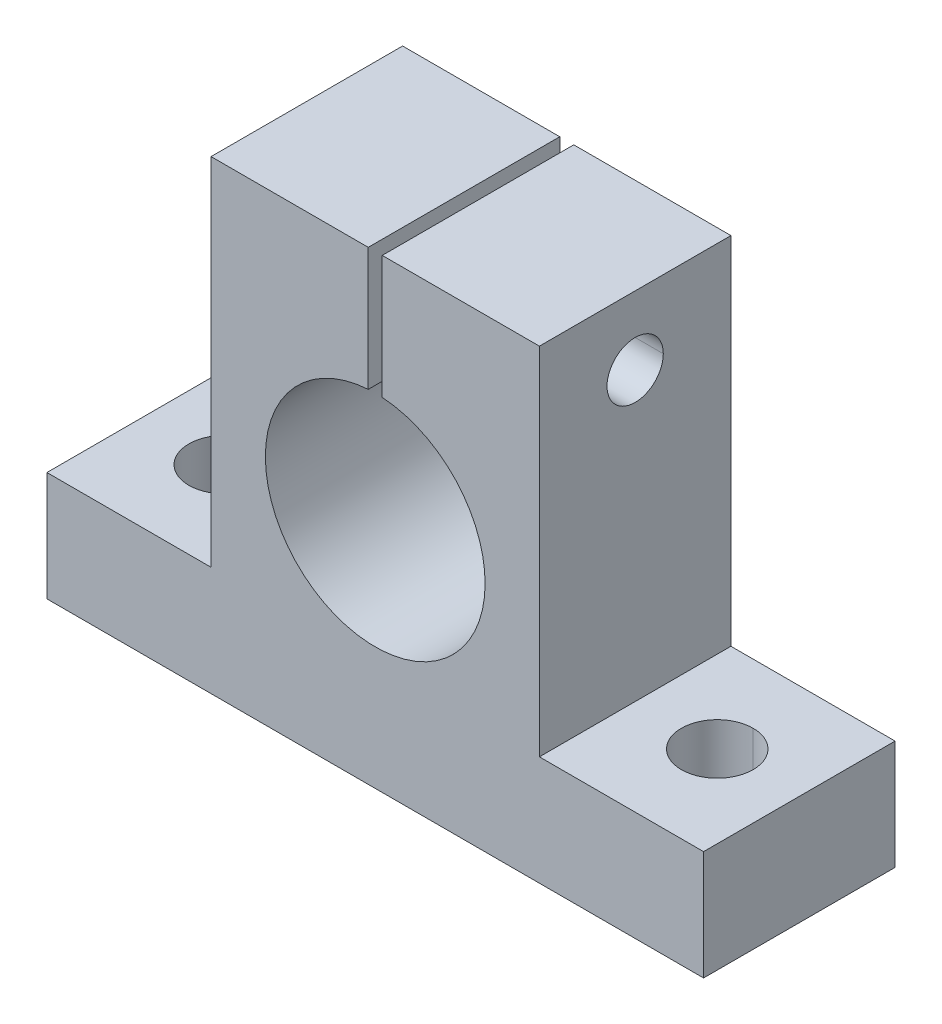
ISO-10303-21;
HEADER;
FILE_DESCRIPTION(('STEP AP214'),'2;1');
FILE_NAME('part.step','',(''),(''),'','','');
FILE_SCHEMA(('AUTOMOTIVE_DESIGN { 1 0 10303 214 1 1 1 1 }'));
ENDSEC;
DATA;
#1=APPLICATION_CONTEXT('core data for automotive mechanical design processes');
#2=APPLICATION_PROTOCOL_DEFINITION('international standard','automotive_design',2000,#1);
#3=PRODUCT_CONTEXT('',#1,'mechanical');
#4=PRODUCT('Part','Part','',(#3));
#5=PRODUCT_RELATED_PRODUCT_CATEGORY('part','',(#4));
#6=PRODUCT_DEFINITION_FORMATION('','',#4);
#7=PRODUCT_DEFINITION_CONTEXT('part definition',#1,'design');
#8=PRODUCT_DEFINITION('design','',#6,#7);
#9=PRODUCT_DEFINITION_SHAPE('','',#8);
#10=(LENGTH_UNIT() NAMED_UNIT(*) SI_UNIT(.MILLI.,.METRE.));
#11=(NAMED_UNIT(*) PLANE_ANGLE_UNIT() SI_UNIT($,.RADIAN.));
#12=(NAMED_UNIT(*) SI_UNIT($,.STERADIAN.) SOLID_ANGLE_UNIT());
#13=UNCERTAINTY_MEASURE_WITH_UNIT(LENGTH_MEASURE(1.E-05),#10,'distance_accuracy_value','');
#14=(GEOMETRIC_REPRESENTATION_CONTEXT(3) GLOBAL_UNCERTAINTY_ASSIGNED_CONTEXT((#13)) GLOBAL_UNIT_ASSIGNED_CONTEXT((#10,
#11,#12)) REPRESENTATION_CONTEXT('',''));
#15=CARTESIAN_POINT('',(0.,0.,0.));
#16=DIRECTION('',(0.,0.,1.));
#17=DIRECTION('',(1.,0.,0.));
#18=AXIS2_PLACEMENT_3D('',#15,#16,#17);
#19=CARTESIAN_POINT('',(-19.05,12.7,11.1125));
#20=DIRECTION('',(0.,-1.,0.));
#21=DIRECTION('',(0.,0.,-1.));
#22=AXIS2_PLACEMENT_3D('',#19,#20,#21);
#23=PLANE('',#22);
#24=CARTESIAN_POINT('',(-28.575,12.7,0.));
#25=DIRECTION('',(0.,1.,0.));
#26=DIRECTION('',(1.,0.,0.));
#27=AXIS2_PLACEMENT_3D('',#24,#25,#26);
#28=CIRCLE('',#27,4.1656);
#29=CARTESIAN_POINT('',(-28.575,12.7,-4.1656));
#30=VERTEX_POINT('',#29);
#31=CARTESIAN_POINT('',(-28.575,12.7,4.1656));
#32=VERTEX_POINT('',#31);
#33=EDGE_CURVE('E11',#30,#32,#28,.T.);
#34=ORIENTED_EDGE('',*,*,#33,.F.);
#35=CARTESIAN_POINT('',(-28.575,12.7,0.));
#36=DIRECTION('',(0.,1.,0.));
#37=DIRECTION('',(0.,0.,1.));
#38=AXIS2_PLACEMENT_3D('',#35,#36,#37);
#39=CIRCLE('',#38,4.1656);
#40=EDGE_CURVE('E24',#32,#30,#39,.T.);
#41=ORIENTED_EDGE('',*,*,#40,.F.);
#42=EDGE_LOOP('',(#34,#41));
#43=FACE_BOUND('',#42,.T.);
#44=DIRECTION('',(-1.,0.,0.));
#45=VECTOR('',#44,1.);
#46=CARTESIAN_POINT('',(-19.05,12.7,-11.1125));
#47=LINE('',#46,#45);
#48=CARTESIAN_POINT('',(-19.05,12.7,-11.1125));
#49=VERTEX_POINT('',#48);
#50=CARTESIAN_POINT('',(-38.1,12.7,-11.1125));
#51=VERTEX_POINT('',#50);
#52=EDGE_CURVE('E389',#49,#51,#47,.T.);
#53=ORIENTED_EDGE('',*,*,#52,.T.);
#54=DIRECTION('',(0.,0.,-1.));
#55=VECTOR('',#54,1.);
#56=CARTESIAN_POINT('',(-38.1,12.7,11.1125));
#57=LINE('',#56,#55);
#58=CARTESIAN_POINT('',(-38.1,12.7,11.1125));
#59=VERTEX_POINT('',#58);
#60=EDGE_CURVE('E166',#59,#51,#57,.T.);
#61=ORIENTED_EDGE('',*,*,#60,.F.);
#62=DIRECTION('',(-1.,0.,0.));
#63=VECTOR('',#62,1.);
#64=CARTESIAN_POINT('',(-19.05,12.7,11.1125));
#65=LINE('',#64,#63);
#66=CARTESIAN_POINT('',(-19.05,12.7,11.1125));
#67=VERTEX_POINT('',#66);
#68=EDGE_CURVE('E381',#67,#59,#65,.T.);
#69=ORIENTED_EDGE('',*,*,#68,.F.);
#70=DIRECTION('',(0.,0.,-1.));
#71=VECTOR('',#70,1.);
#72=CARTESIAN_POINT('',(-19.05,12.7,11.1125));
#73=LINE('',#72,#71);
#74=EDGE_CURVE('E377',#67,#49,#73,.T.);
#75=ORIENTED_EDGE('',*,*,#74,.T.);
#76=EDGE_LOOP('',(#53,#61,#69,#75));
#77=FACE_BOUND('',#76,.T.);
#78=ADVANCED_FACE('F16',(#43,#77),#23,.F.);
#79=CARTESIAN_POINT('',(-19.05,53.975,11.1125));
#80=DIRECTION('',(1.,0.,0.));
#81=DIRECTION('',(0.,0.,-1.));
#82=AXIS2_PLACEMENT_3D('',#79,#80,#81);
#83=PLANE('',#82);
#84=CARTESIAN_POINT('',(-19.05,46.0248,0.));
#85=DIRECTION('',(1.,0.,0.));
#86=DIRECTION('',(0.,0.,-1.));
#87=AXIS2_PLACEMENT_3D('',#84,#85,#86);
#88=CIRCLE('',#87,2.48793);
#89=CARTESIAN_POINT('',(-19.05,46.0248,-2.48793));
#90=VERTEX_POINT('',#89);
#91=CARTESIAN_POINT('',(-19.05,46.0248,2.48793));
#92=VERTEX_POINT('',#91);
#93=EDGE_CURVE('E373',#90,#92,#88,.T.);
#94=ORIENTED_EDGE('',*,*,#93,.T.);
#95=CARTESIAN_POINT('',(-19.05,46.0248,0.));
#96=DIRECTION('',(1.,0.,0.));
#97=DIRECTION('',(0.,0.,-1.));
#98=AXIS2_PLACEMENT_3D('',#95,#96,#97);
#99=CIRCLE('',#98,2.48793);
#100=EDGE_CURVE('E369',#92,#90,#99,.T.);
#101=ORIENTED_EDGE('',*,*,#100,.T.);
#102=EDGE_LOOP('',(#94,#101));
#103=FACE_BOUND('',#102,.T.);
#104=DIRECTION('',(0.,-1.,0.));
#105=VECTOR('',#104,1.);
#106=CARTESIAN_POINT('',(-19.05,53.975,-11.1125));
#107=LINE('',#106,#105);
#108=CARTESIAN_POINT('',(-19.05,53.975,-11.1125));
#109=VERTEX_POINT('',#108);
#110=EDGE_CURVE('E364',#109,#49,#107,.T.);
#111=ORIENTED_EDGE('',*,*,#110,.T.);
#112=ORIENTED_EDGE('',*,*,#74,.F.);
#113=DIRECTION('',(0.,-1.,0.));
#114=VECTOR('',#113,1.);
#115=CARTESIAN_POINT('',(-19.05,53.975,11.1125));
#116=LINE('',#115,#114);
#117=CARTESIAN_POINT('',(-19.05,53.975,11.1125));
#118=VERTEX_POINT('',#117);
#119=EDGE_CURVE('E359',#118,#67,#116,.T.);
#120=ORIENTED_EDGE('',*,*,#119,.F.);
#121=DIRECTION('',(0.,0.,-1.));
#122=VECTOR('',#121,1.);
#123=CARTESIAN_POINT('',(-19.05,53.975,11.1125));
#124=LINE('',#123,#122);
#125=EDGE_CURVE('E355',#118,#109,#124,.T.);
#126=ORIENTED_EDGE('',*,*,#125,.T.);
#127=EDGE_LOOP('',(#111,#112,#120,#126));
#128=FACE_BOUND('',#127,.T.);
#129=ADVANCED_FACE('F441',(#103,#128),#83,.F.);
#130=CARTESIAN_POINT('',(-0.8128,53.975,11.1125));
#131=DIRECTION('',(0.,-1.,0.));
#132=DIRECTION('',(0.,0.,-1.));
#133=AXIS2_PLACEMENT_3D('',#130,#131,#132);
#134=PLANE('',#133);
#135=DIRECTION('',(-1.,0.,0.));
#136=VECTOR('',#135,1.);
#137=CARTESIAN_POINT('',(-0.8128,53.975,-11.1125));
#138=LINE('',#137,#136);
#139=CARTESIAN_POINT('',(-0.8128,53.975,-11.1125));
#140=VERTEX_POINT('',#139);
#141=EDGE_CURVE('E350',#140,#109,#138,.T.);
#142=ORIENTED_EDGE('',*,*,#141,.T.);
#143=ORIENTED_EDGE('',*,*,#125,.F.);
#144=DIRECTION('',(-1.,0.,0.));
#145=VECTOR('',#144,1.);
#146=CARTESIAN_POINT('',(-0.8128,53.975,11.1125));
#147=LINE('',#146,#145);
#148=CARTESIAN_POINT('',(-0.8128,53.975,11.1125));
#149=VERTEX_POINT('',#148);
#150=EDGE_CURVE('E345',#149,#118,#147,.T.);
#151=ORIENTED_EDGE('',*,*,#150,.F.);
#152=DIRECTION('',(0.,0.,-1.));
#153=VECTOR('',#152,1.);
#154=CARTESIAN_POINT('',(-0.8128,53.975,11.1125));
#155=LINE('',#154,#153);
#156=EDGE_CURVE('E341',#149,#140,#155,.T.);
#157=ORIENTED_EDGE('',*,*,#156,.T.);
#158=EDGE_LOOP('',(#142,#143,#151,#157));
#159=FACE_BOUND('',#158,.T.);
#160=ADVANCED_FACE('F447',(#159),#134,.F.);
#161=CARTESIAN_POINT('',(-0.8128,39.6996676535361,11.1125));
#162=DIRECTION('',(-1.,0.,0.));
#163=DIRECTION('',(0.,0.,1.));
#164=AXIS2_PLACEMENT_3D('',#161,#162,#163);
#165=PLANE('',#164);
#166=DIRECTION('',(0.,1.,0.));
#167=VECTOR('',#166,1.);
#168=CARTESIAN_POINT('',(-0.8128,39.6996676535361,-11.1125));
#169=LINE('',#168,#167);
#170=CARTESIAN_POINT('',(-0.8128,39.6996676535361,-11.1125));
#171=VERTEX_POINT('',#170);
#172=EDGE_CURVE('E336',#171,#140,#169,.T.);
#173=ORIENTED_EDGE('',*,*,#172,.T.);
#174=ORIENTED_EDGE('',*,*,#156,.F.);
#175=DIRECTION('',(0.,1.,0.));
#176=VECTOR('',#175,1.);
#177=CARTESIAN_POINT('',(-0.8128,39.6996676535361,11.1125));
#178=LINE('',#177,#176);
#179=CARTESIAN_POINT('',(-0.8128,39.6996676535361,11.1125));
#180=VERTEX_POINT('',#179);
#181=EDGE_CURVE('E331',#180,#149,#178,.T.);
#182=ORIENTED_EDGE('',*,*,#181,.F.);
#183=DIRECTION('',(0.,0.,-1.));
#184=VECTOR('',#183,1.);
#185=CARTESIAN_POINT('',(-0.8128,39.6996676535361,11.1125));
#186=LINE('',#185,#184);
#187=EDGE_CURVE('E327',#180,#171,#186,.T.);
#188=ORIENTED_EDGE('',*,*,#187,.T.);
#189=EDGE_LOOP('',(#173,#174,#182,#188));
#190=FACE_BOUND('',#189,.T.);
#191=CARTESIAN_POINT('',(-0.8128,46.0248,0.));
#192=DIRECTION('',(1.,0.,0.));
#193=DIRECTION('',(0.,0.,-1.));
#194=AXIS2_PLACEMENT_3D('',#191,#192,#193);
#195=CIRCLE('',#194,2.48793);
#196=CARTESIAN_POINT('',(-0.812799999999999,46.0248,2.48793));
#197=VERTEX_POINT('',#196);
#198=CARTESIAN_POINT('',(-0.8128,46.0248,-2.48793));
#199=VERTEX_POINT('',#198);
#200=EDGE_CURVE('E322',#197,#199,#195,.T.);
#201=ORIENTED_EDGE('',*,*,#200,.F.);
#202=CARTESIAN_POINT('',(-0.8128,46.0248,0.));
#203=DIRECTION('',(1.,0.,0.));
#204=DIRECTION('',(0.,0.,-1.));
#205=AXIS2_PLACEMENT_3D('',#202,#203,#204);
#206=CIRCLE('',#205,2.48793);
#207=EDGE_CURVE('E317',#199,#197,#206,.T.);
#208=ORIENTED_EDGE('',*,*,#207,.F.);
#209=EDGE_LOOP('',(#201,#208));
#210=FACE_BOUND('',#209,.T.);
#211=ADVANCED_FACE('F450',(#190,#210),#165,.F.);
#212=CARTESIAN_POINT('',(19.05,46.0248,0.));
#213=DIRECTION('',(1.,0.,0.));
#214=DIRECTION('',(0.,-1.,0.));
#215=AXIS2_PLACEMENT_3D('',#212,#213,#214);
#216=CYLINDRICAL_SURFACE('',#215,2.48793);
#217=DIRECTION('',(1.,0.,0.));
#218=VECTOR('',#217,1.);
#219=CARTESIAN_POINT('',(-19.05,46.0248,2.48793));
#220=LINE('',#219,#218);
#221=EDGE_CURVE('E312',#92,#197,#220,.T.);
#222=ORIENTED_EDGE('',*,*,#221,.F.);
#223=ORIENTED_EDGE('',*,*,#93,.F.);
#224=DIRECTION('',(1.,0.,0.));
#225=VECTOR('',#224,1.);
#226=CARTESIAN_POINT('',(-19.05,46.0248,-2.48793));
#227=LINE('',#226,#225);
#228=EDGE_CURVE('E307',#90,#199,#227,.T.);
#229=ORIENTED_EDGE('',*,*,#228,.T.);
#230=ORIENTED_EDGE('',*,*,#207,.T.);
#231=EDGE_LOOP('',(#222,#223,#229,#230));
#232=FACE_BOUND('',#231,.T.);
#233=ADVANCED_FACE('F498',(#232),#216,.F.);
#234=CARTESIAN_POINT('',(19.05,46.0248,0.));
#235=DIRECTION('',(1.,0.,0.));
#236=DIRECTION('',(0.,1.,0.));
#237=AXIS2_PLACEMENT_3D('',#234,#235,#236);
#238=CYLINDRICAL_SURFACE('',#237,2.48793);
#239=ORIENTED_EDGE('',*,*,#221,.T.);
#240=ORIENTED_EDGE('',*,*,#200,.T.);
#241=ORIENTED_EDGE('',*,*,#228,.F.);
#242=ORIENTED_EDGE('',*,*,#100,.F.);
#243=EDGE_LOOP('',(#239,#240,#241,#242));
#244=FACE_BOUND('',#243,.T.);
#245=ADVANCED_FACE('F501',(#244),#238,.F.);
#246=CARTESIAN_POINT('',(0.,26.9748,11.1125));
#247=DIRECTION('',(0.,0.,-1.));
#248=DIRECTION('',(0.,1.,0.));
#249=AXIS2_PLACEMENT_3D('',#246,#247,#248);
#250=CYLINDRICAL_SURFACE('',#249,12.7508000000002);
#251=CARTESIAN_POINT('',(0.,26.9748,-11.1125));
#252=DIRECTION('',(0.,0.,1.));
#253=DIRECTION('',(1.,0.,0.));
#254=AXIS2_PLACEMENT_3D('',#251,#252,#253);
#255=CIRCLE('',#254,12.7508000000002);
#256=CARTESIAN_POINT('',(0.8128,39.6996676535361,-11.1125));
#257=VERTEX_POINT('',#256);
#258=EDGE_CURVE('E302',#171,#257,#255,.T.);
#259=ORIENTED_EDGE('',*,*,#258,.F.);
#260=ORIENTED_EDGE('',*,*,#187,.F.);
#261=CARTESIAN_POINT('',(0.,26.9748,11.1125));
#262=DIRECTION('',(0.,0.,1.));
#263=DIRECTION('',(1.,0.,0.));
#264=AXIS2_PLACEMENT_3D('',#261,#262,#263);
#265=CIRCLE('',#264,12.7508000000002);
#266=CARTESIAN_POINT('',(0.8128,39.6996676535361,11.1125));
#267=VERTEX_POINT('',#266);
#268=EDGE_CURVE('E298',#180,#267,#265,.T.);
#269=ORIENTED_EDGE('',*,*,#268,.T.);
#270=DIRECTION('',(0.,0.,-1.));
#271=VECTOR('',#270,1.);
#272=CARTESIAN_POINT('',(0.8128,39.6996676535361,11.1125));
#273=LINE('',#272,#271);
#274=EDGE_CURVE('E294',#267,#257,#273,.T.);
#275=ORIENTED_EDGE('',*,*,#274,.T.);
#276=EDGE_LOOP('',(#259,#260,#269,#275));
#277=FACE_BOUND('',#276,.T.);
#278=ADVANCED_FACE('F456',(#277),#250,.F.);
#279=CARTESIAN_POINT('',(0.8128,53.975,11.1125));
#280=DIRECTION('',(1.,0.,0.));
#281=DIRECTION('',(0.,0.,-1.));
#282=AXIS2_PLACEMENT_3D('',#279,#280,#281);
#283=PLANE('',#282);
#284=CARTESIAN_POINT('',(0.8128,46.0248,0.));
#285=DIRECTION('',(-1.,0.,0.));
#286=DIRECTION('',(0.,0.,-1.));
#287=AXIS2_PLACEMENT_3D('',#284,#285,#286);
#288=CIRCLE('',#287,3.2639);
#289=CARTESIAN_POINT('',(0.812799999999999,46.0248,3.2639));
#290=VERTEX_POINT('',#289);
#291=CARTESIAN_POINT('',(0.8128,46.0248,-3.2639));
#292=VERTEX_POINT('',#291);
#293=EDGE_CURVE('E289',#290,#292,#288,.T.);
#294=ORIENTED_EDGE('',*,*,#293,.F.);
#295=CARTESIAN_POINT('',(0.8128,46.0248,0.));
#296=DIRECTION('',(-1.,0.,0.));
#297=DIRECTION('',(0.,0.,-1.));
#298=AXIS2_PLACEMENT_3D('',#295,#296,#297);
#299=CIRCLE('',#298,3.2639);
#300=EDGE_CURVE('E284',#292,#290,#299,.T.);
#301=ORIENTED_EDGE('',*,*,#300,.F.);
#302=EDGE_LOOP('',(#294,#301));
#303=FACE_BOUND('',#302,.T.);
#304=DIRECTION('',(0.,-1.,0.));
#305=VECTOR('',#304,1.);
#306=CARTESIAN_POINT('',(0.8128,53.975,-11.1125));
#307=LINE('',#306,#305);
#308=CARTESIAN_POINT('',(0.8128,53.975,-11.1125));
#309=VERTEX_POINT('',#308);
#310=EDGE_CURVE('E279',#309,#257,#307,.T.);
#311=ORIENTED_EDGE('',*,*,#310,.T.);
#312=ORIENTED_EDGE('',*,*,#274,.F.);
#313=DIRECTION('',(0.,-1.,0.));
#314=VECTOR('',#313,1.);
#315=CARTESIAN_POINT('',(0.8128,53.975,11.1125));
#316=LINE('',#315,#314);
#317=CARTESIAN_POINT('',(0.8128,53.975,11.1125));
#318=VERTEX_POINT('',#317);
#319=EDGE_CURVE('E274',#318,#267,#316,.T.);
#320=ORIENTED_EDGE('',*,*,#319,.F.);
#321=DIRECTION('',(0.,0.,-1.));
#322=VECTOR('',#321,1.);
#323=CARTESIAN_POINT('',(0.8128,53.975,11.1125));
#324=LINE('',#323,#322);
#325=EDGE_CURVE('E270',#318,#309,#324,.T.);
#326=ORIENTED_EDGE('',*,*,#325,.T.);
#327=EDGE_LOOP('',(#311,#312,#320,#326));
#328=FACE_BOUND('',#327,.T.);
#329=ADVANCED_FACE('F462',(#303,#328),#283,.F.);
#330=CARTESIAN_POINT('',(19.05,53.975,11.1125));
#331=DIRECTION('',(0.,-1.,0.));
#332=DIRECTION('',(0.,0.,-1.));
#333=AXIS2_PLACEMENT_3D('',#330,#331,#332);
#334=PLANE('',#333);
#335=DIRECTION('',(-1.,0.,0.));
#336=VECTOR('',#335,1.);
#337=CARTESIAN_POINT('',(19.05,53.975,-11.1125));
#338=LINE('',#337,#336);
#339=CARTESIAN_POINT('',(19.05,53.975,-11.1125));
#340=VERTEX_POINT('',#339);
#341=EDGE_CURVE('E265',#340,#309,#338,.T.);
#342=ORIENTED_EDGE('',*,*,#341,.T.);
#343=ORIENTED_EDGE('',*,*,#325,.F.);
#344=DIRECTION('',(-1.,0.,0.));
#345=VECTOR('',#344,1.);
#346=CARTESIAN_POINT('',(19.05,53.975,11.1125));
#347=LINE('',#346,#345);
#348=CARTESIAN_POINT('',(19.05,53.975,11.1125));
#349=VERTEX_POINT('',#348);
#350=EDGE_CURVE('E260',#349,#318,#347,.T.);
#351=ORIENTED_EDGE('',*,*,#350,.F.);
#352=DIRECTION('',(0.,0.,-1.));
#353=VECTOR('',#352,1.);
#354=CARTESIAN_POINT('',(19.05,53.975,11.1125));
#355=LINE('',#354,#353);
#356=EDGE_CURVE('E256',#349,#340,#355,.T.);
#357=ORIENTED_EDGE('',*,*,#356,.T.);
#358=EDGE_LOOP('',(#342,#343,#351,#357));
#359=FACE_BOUND('',#358,.T.);
#360=ADVANCED_FACE('F465',(#359),#334,.F.);
#361=CARTESIAN_POINT('',(19.05,12.7,11.1125));
#362=DIRECTION('',(-1.,0.,0.));
#363=DIRECTION('',(0.,0.,1.));
#364=AXIS2_PLACEMENT_3D('',#361,#362,#363);
#365=PLANE('',#364);
#366=CARTESIAN_POINT('',(19.05,46.0248,0.));
#367=DIRECTION('',(1.,0.,0.));
#368=DIRECTION('',(0.,0.,-1.));
#369=AXIS2_PLACEMENT_3D('',#366,#367,#368);
#370=CIRCLE('',#369,3.2639);
#371=CARTESIAN_POINT('',(19.05,46.0248,3.2639));
#372=VERTEX_POINT('',#371);
#373=CARTESIAN_POINT('',(19.05,46.0248,-3.2639));
#374=VERTEX_POINT('',#373);
#375=EDGE_CURVE('E251',#372,#374,#370,.T.);
#376=ORIENTED_EDGE('',*,*,#375,.F.);
#377=CARTESIAN_POINT('',(19.05,46.0248,0.));
#378=DIRECTION('',(1.,0.,0.));
#379=DIRECTION('',(0.,0.,-1.));
#380=AXIS2_PLACEMENT_3D('',#377,#378,#379);
#381=CIRCLE('',#380,3.2639);
#382=EDGE_CURVE('E246',#374,#372,#381,.T.);
#383=ORIENTED_EDGE('',*,*,#382,.F.);
#384=EDGE_LOOP('',(#376,#383));
#385=FACE_BOUND('',#384,.T.);
#386=DIRECTION('',(0.,1.,0.));
#387=VECTOR('',#386,1.);
#388=CARTESIAN_POINT('',(19.05,12.7,-11.1125));
#389=LINE('',#388,#387);
#390=CARTESIAN_POINT('',(19.05,12.7,-11.1125));
#391=VERTEX_POINT('',#390);
#392=EDGE_CURVE('E241',#391,#340,#389,.T.);
#393=ORIENTED_EDGE('',*,*,#392,.T.);
#394=ORIENTED_EDGE('',*,*,#356,.F.);
#395=DIRECTION('',(0.,1.,0.));
#396=VECTOR('',#395,1.);
#397=CARTESIAN_POINT('',(19.05,12.7,11.1125));
#398=LINE('',#397,#396);
#399=CARTESIAN_POINT('',(19.05,12.7,11.1125));
#400=VERTEX_POINT('',#399);
#401=EDGE_CURVE('E236',#400,#349,#398,.T.);
#402=ORIENTED_EDGE('',*,*,#401,.F.);
#403=DIRECTION('',(0.,0.,-1.));
#404=VECTOR('',#403,1.);
#405=CARTESIAN_POINT('',(19.05,12.7,11.1125));
#406=LINE('',#405,#404);
#407=EDGE_CURVE('E232',#400,#391,#406,.T.);
#408=ORIENTED_EDGE('',*,*,#407,.T.);
#409=EDGE_LOOP('',(#393,#394,#402,#408));
#410=FACE_BOUND('',#409,.T.);
#411=ADVANCED_FACE('F468',(#385,#410),#365,.F.);
#412=CARTESIAN_POINT('',(38.1,12.7,11.1125));
#413=DIRECTION('',(0.,-1.,0.));
#414=DIRECTION('',(0.,0.,-1.));
#415=AXIS2_PLACEMENT_3D('',#412,#413,#414);
#416=PLANE('',#415);
#417=CARTESIAN_POINT('',(28.575,12.7,0.));
#418=DIRECTION('',(0.,1.,0.));
#419=DIRECTION('',(1.,0.,0.));
#420=AXIS2_PLACEMENT_3D('',#417,#418,#419);
#421=CIRCLE('',#420,4.1656);
#422=CARTESIAN_POINT('',(28.575,12.7,-4.1656));
#423=VERTEX_POINT('',#422);
#424=CARTESIAN_POINT('',(28.575,12.7,4.1656));
#425=VERTEX_POINT('',#424);
#426=EDGE_CURVE('E227',#423,#425,#421,.T.);
#427=ORIENTED_EDGE('',*,*,#426,.F.);
#428=CARTESIAN_POINT('',(28.575,12.7,0.));
#429=DIRECTION('',(0.,1.,0.));
#430=DIRECTION('',(0.,0.,1.));
#431=AXIS2_PLACEMENT_3D('',#428,#429,#430);
#432=CIRCLE('',#431,4.1656);
#433=EDGE_CURVE('E222',#425,#423,#432,.T.);
#434=ORIENTED_EDGE('',*,*,#433,.F.);
#435=EDGE_LOOP('',(#427,#434));
#436=FACE_BOUND('',#435,.T.);
#437=DIRECTION('',(-1.,0.,0.));
#438=VECTOR('',#437,1.);
#439=CARTESIAN_POINT('',(38.1,12.7,-11.1125));
#440=LINE('',#439,#438);
#441=CARTESIAN_POINT('',(38.1,12.7,-11.1125));
#442=VERTEX_POINT('',#441);
#443=EDGE_CURVE('E217',#442,#391,#440,.T.);
#444=ORIENTED_EDGE('',*,*,#443,.T.);
#445=ORIENTED_EDGE('',*,*,#407,.F.);
#446=DIRECTION('',(-1.,0.,0.));
#447=VECTOR('',#446,1.);
#448=CARTESIAN_POINT('',(38.1,12.7,11.1125));
#449=LINE('',#448,#447);
#450=CARTESIAN_POINT('',(38.1,12.7,11.1125));
#451=VERTEX_POINT('',#450);
#452=EDGE_CURVE('E212',#451,#400,#449,.T.);
#453=ORIENTED_EDGE('',*,*,#452,.F.);
#454=DIRECTION('',(0.,0.,-1.));
#455=VECTOR('',#454,1.);
#456=CARTESIAN_POINT('',(38.1,12.7,11.1125));
#457=LINE('',#456,#455);
#458=EDGE_CURVE('E208',#451,#442,#457,.T.);
#459=ORIENTED_EDGE('',*,*,#458,.T.);
#460=EDGE_LOOP('',(#444,#445,#453,#459));
#461=FACE_BOUND('',#460,.T.);
#462=ADVANCED_FACE('F471',(#436,#461),#416,.F.);
#463=CARTESIAN_POINT('',(38.1,0.,11.1125));
#464=DIRECTION('',(-1.,0.,0.));
#465=DIRECTION('',(0.,0.,1.));
#466=AXIS2_PLACEMENT_3D('',#463,#464,#465);
#467=PLANE('',#466);
#468=DIRECTION('',(0.,1.,0.));
#469=VECTOR('',#468,1.);
#470=CARTESIAN_POINT('',(38.1,0.,-11.1125));
#471=LINE('',#470,#469);
#472=CARTESIAN_POINT('',(38.1,0.,-11.1125));
#473=VERTEX_POINT('',#472);
#474=EDGE_CURVE('E174',#473,#442,#471,.T.);
#475=ORIENTED_EDGE('',*,*,#474,.T.);
#476=ORIENTED_EDGE('',*,*,#458,.F.);
#477=DIRECTION('',(0.,1.,0.));
#478=VECTOR('',#477,1.);
#479=CARTESIAN_POINT('',(38.1,0.,11.1125));
#480=LINE('',#479,#478);
#481=CARTESIAN_POINT('',(38.1,0.,11.1125));
#482=VERTEX_POINT('',#481);
#483=EDGE_CURVE('E200',#482,#451,#480,.T.);
#484=ORIENTED_EDGE('',*,*,#483,.F.);
#485=DIRECTION('',(0.,0.,-1.));
#486=VECTOR('',#485,1.);
#487=CARTESIAN_POINT('',(38.1,0.,11.1125));
#488=LINE('',#487,#486);
#489=EDGE_CURVE('E196',#482,#473,#488,.T.);
#490=ORIENTED_EDGE('',*,*,#489,.T.);
#491=EDGE_LOOP('',(#475,#476,#484,#490));
#492=FACE_BOUND('',#491,.T.);
#493=ADVANCED_FACE('F474',(#492),#467,.F.);
#494=CARTESIAN_POINT('',(-38.1,0.,11.1125));
#495=DIRECTION('',(0.,1.,0.));
#496=DIRECTION('',(0.,0.,1.));
#497=AXIS2_PLACEMENT_3D('',#494,#495,#496);
#498=PLANE('',#497);
#499=CARTESIAN_POINT('',(-28.575,0.,0.));
#500=DIRECTION('',(0.,1.,0.));
#501=DIRECTION('',(1.,0.,0.));
#502=AXIS2_PLACEMENT_3D('',#499,#500,#501);
#503=CIRCLE('',#502,4.1656);
#504=CARTESIAN_POINT('',(-28.575,0.,-4.1656));
#505=VERTEX_POINT('',#504);
#506=CARTESIAN_POINT('',(-28.575,0.,4.1656));
#507=VERTEX_POINT('',#506);
#508=EDGE_CURVE('E192',#505,#507,#503,.T.);
#509=ORIENTED_EDGE('',*,*,#508,.T.);
#510=CARTESIAN_POINT('',(-28.575,0.,0.));
#511=DIRECTION('',(0.,1.,0.));
#512=DIRECTION('',(0.,0.,1.));
#513=AXIS2_PLACEMENT_3D('',#510,#511,#512);
#514=CIRCLE('',#513,4.1656);
#515=EDGE_CURVE('E188',#507,#505,#514,.T.);
#516=ORIENTED_EDGE('',*,*,#515,.T.);
#517=EDGE_LOOP('',(#509,#516));
#518=FACE_BOUND('',#517,.T.);
#519=CARTESIAN_POINT('',(28.575,0.,0.));
#520=DIRECTION('',(0.,1.,0.));
#521=DIRECTION('',(1.,0.,0.));
#522=AXIS2_PLACEMENT_3D('',#519,#520,#521);
#523=CIRCLE('',#522,4.1656);
#524=CARTESIAN_POINT('',(28.575,0.,-4.1656));
#525=VERTEX_POINT('',#524);
#526=CARTESIAN_POINT('',(28.575,0.,4.1656));
#527=VERTEX_POINT('',#526);
#528=EDGE_CURVE('E177',#525,#527,#523,.T.);
#529=ORIENTED_EDGE('',*,*,#528,.T.);
#530=CARTESIAN_POINT('',(28.575,0.,0.));
#531=DIRECTION('',(0.,1.,0.));
#532=DIRECTION('',(0.,0.,1.));
#533=AXIS2_PLACEMENT_3D('',#530,#531,#532);
#534=CIRCLE('',#533,4.1656);
#535=EDGE_CURVE('E175',#527,#525,#534,.T.);
#536=ORIENTED_EDGE('',*,*,#535,.T.);
#537=EDGE_LOOP('',(#529,#536));
#538=FACE_BOUND('',#537,.T.);
#539=DIRECTION('',(1.,0.,0.));
#540=VECTOR('',#539,1.);
#541=CARTESIAN_POINT('',(-38.1,0.,-11.1125));
#542=LINE('',#541,#540);
#543=CARTESIAN_POINT('',(-38.1,0.,-11.1125));
#544=VERTEX_POINT('',#543);
#545=EDGE_CURVE('E154',#544,#473,#542,.T.);
#546=ORIENTED_EDGE('',*,*,#545,.T.);
#547=ORIENTED_EDGE('',*,*,#489,.F.);
#548=DIRECTION('',(1.,0.,0.));
#549=VECTOR('',#548,1.);
#550=CARTESIAN_POINT('',(-38.1,0.,11.1125));
#551=LINE('',#550,#549);
#552=CARTESIAN_POINT('',(-38.1,0.,11.1125));
#553=VERTEX_POINT('',#552);
#554=EDGE_CURVE('E157',#553,#482,#551,.T.);
#555=ORIENTED_EDGE('',*,*,#554,.F.);
#556=DIRECTION('',(0.,0.,-1.));
#557=VECTOR('',#556,1.);
#558=CARTESIAN_POINT('',(-38.1,0.,11.1125));
#559=LINE('',#558,#557);
#560=EDGE_CURVE('E149',#553,#544,#559,.T.);
#561=ORIENTED_EDGE('',*,*,#560,.T.);
#562=EDGE_LOOP('',(#546,#547,#555,#561));
#563=FACE_BOUND('',#562,.T.);
#564=ADVANCED_FACE('F151',(#518,#538,#563),#498,.F.);
#565=CARTESIAN_POINT('',(-38.1,12.7,11.1125));
#566=DIRECTION('',(1.,0.,0.));
#567=DIRECTION('',(0.,0.,-1.));
#568=AXIS2_PLACEMENT_3D('',#565,#566,#567);
#569=PLANE('',#568);
#570=DIRECTION('',(0.,-1.,0.));
#571=VECTOR('',#570,1.);
#572=CARTESIAN_POINT('',(-38.1,12.7,-11.1125));
#573=LINE('',#572,#571);
#574=EDGE_CURVE('E161',#51,#544,#573,.T.);
#575=ORIENTED_EDGE('',*,*,#574,.T.);
#576=ORIENTED_EDGE('',*,*,#560,.F.);
#577=DIRECTION('',(0.,-1.,0.));
#578=VECTOR('',#577,1.);
#579=CARTESIAN_POINT('',(-38.1,12.7,11.1125));
#580=LINE('',#579,#578);
#581=EDGE_CURVE('E169',#59,#553,#580,.T.);
#582=ORIENTED_EDGE('',*,*,#581,.F.);
#583=ORIENTED_EDGE('',*,*,#60,.T.);
#584=EDGE_LOOP('',(#575,#576,#582,#583));
#585=FACE_BOUND('',#584,.T.);
#586=ADVANCED_FACE('F165',(#585),#569,.F.);
#587=CARTESIAN_POINT('',(0.,26.9748,11.1125));
#588=DIRECTION('',(0.,0.,1.));
#589=DIRECTION('',(1.,0.,0.));
#590=AXIS2_PLACEMENT_3D('',#587,#588,#589);
#591=PLANE('',#590);
#592=ORIENTED_EDGE('',*,*,#68,.T.);
#593=ORIENTED_EDGE('',*,*,#581,.T.);
#594=ORIENTED_EDGE('',*,*,#554,.T.);
#595=ORIENTED_EDGE('',*,*,#483,.T.);
#596=ORIENTED_EDGE('',*,*,#452,.T.);
#597=ORIENTED_EDGE('',*,*,#401,.T.);
#598=ORIENTED_EDGE('',*,*,#350,.T.);
#599=ORIENTED_EDGE('',*,*,#319,.T.);
#600=ORIENTED_EDGE('',*,*,#268,.F.);
#601=ORIENTED_EDGE('',*,*,#181,.T.);
#602=ORIENTED_EDGE('',*,*,#150,.T.);
#603=ORIENTED_EDGE('',*,*,#119,.T.);
#604=EDGE_LOOP('',(#592,#593,#594,#595,#596,#597,#598,#599,#600,#601,#602,#603));
#605=FACE_BOUND('',#604,.T.);
#606=ADVANCED_FACE('F437',(#605),#591,.T.);
#607=CARTESIAN_POINT('',(0.,26.9748,-11.1125));
#608=DIRECTION('',(0.,0.,1.));
#609=DIRECTION('',(1.,0.,0.));
#610=AXIS2_PLACEMENT_3D('',#607,#608,#609);
#611=PLANE('',#610);
#612=ORIENTED_EDGE('',*,*,#52,.F.);
#613=ORIENTED_EDGE('',*,*,#110,.F.);
#614=ORIENTED_EDGE('',*,*,#141,.F.);
#615=ORIENTED_EDGE('',*,*,#172,.F.);
#616=ORIENTED_EDGE('',*,*,#258,.T.);
#617=ORIENTED_EDGE('',*,*,#310,.F.);
#618=ORIENTED_EDGE('',*,*,#341,.F.);
#619=ORIENTED_EDGE('',*,*,#392,.F.);
#620=ORIENTED_EDGE('',*,*,#443,.F.);
#621=ORIENTED_EDGE('',*,*,#474,.F.);
#622=ORIENTED_EDGE('',*,*,#545,.F.);
#623=ORIENTED_EDGE('',*,*,#574,.F.);
#624=EDGE_LOOP('',(#612,#613,#614,#615,#616,#617,#618,#619,#620,#621,#622,#623));
#625=FACE_BOUND('',#624,.T.);
#626=ADVANCED_FACE('F171',(#625),#611,.F.);
#627=CARTESIAN_POINT('',(28.575,12.7,0.));
#628=DIRECTION('',(0.,-1.,0.));
#629=DIRECTION('',(-1.,0.,0.));
#630=AXIS2_PLACEMENT_3D('',#627,#628,#629);
#631=CYLINDRICAL_SURFACE('',#630,4.1656);
#632=DIRECTION('',(0.,-1.,0.));
#633=VECTOR('',#632,1.);
#634=CARTESIAN_POINT('',(28.575,12.7,4.1656));
#635=LINE('',#634,#633);
#636=EDGE_CURVE('E423',#425,#527,#635,.T.);
#637=ORIENTED_EDGE('',*,*,#636,.F.);
#638=ORIENTED_EDGE('',*,*,#433,.T.);
#639=DIRECTION('',(0.,-1.,0.));
#640=VECTOR('',#639,1.);
#641=CARTESIAN_POINT('',(28.575,12.7,-4.1656));
#642=LINE('',#641,#640);
#643=EDGE_CURVE('E406',#423,#525,#642,.T.);
#644=ORIENTED_EDGE('',*,*,#643,.T.);
#645=ORIENTED_EDGE('',*,*,#535,.F.);
#646=EDGE_LOOP('',(#637,#638,#644,#645));
#647=FACE_BOUND('',#646,.T.);
#648=ADVANCED_FACE('F541',(#647),#631,.F.);
#649=CARTESIAN_POINT('',(28.575,12.7,0.));
#650=DIRECTION('',(0.,-1.,0.));
#651=DIRECTION('',(1.,0.,0.));
#652=AXIS2_PLACEMENT_3D('',#649,#650,#651);
#653=CYLINDRICAL_SURFACE('',#652,4.1656);
#654=ORIENTED_EDGE('',*,*,#636,.T.);
#655=ORIENTED_EDGE('',*,*,#528,.F.);
#656=ORIENTED_EDGE('',*,*,#643,.F.);
#657=ORIENTED_EDGE('',*,*,#426,.T.);
#658=EDGE_LOOP('',(#654,#655,#656,#657));
#659=FACE_BOUND('',#658,.T.);
#660=ADVANCED_FACE('F538',(#659),#653,.F.);
#661=CARTESIAN_POINT('',(-28.575,12.7,0.));
#662=DIRECTION('',(0.,-1.,0.));
#663=DIRECTION('',(-1.,0.,0.));
#664=AXIS2_PLACEMENT_3D('',#661,#662,#663);
#665=CYLINDRICAL_SURFACE('',#664,4.1656);
#666=DIRECTION('',(0.,-1.,0.));
#667=VECTOR('',#666,1.);
#668=CARTESIAN_POINT('',(-28.575,12.7,4.1656));
#669=LINE('',#668,#667);
#670=EDGE_CURVE('E403',#32,#507,#669,.T.);
#671=ORIENTED_EDGE('',*,*,#670,.F.);
#672=ORIENTED_EDGE('',*,*,#40,.T.);
#673=DIRECTION('',(0.,-1.,0.));
#674=VECTOR('',#673,1.);
#675=CARTESIAN_POINT('',(-28.575,12.7,-4.1656));
#676=LINE('',#675,#674);
#677=EDGE_CURVE('E401',#30,#505,#676,.T.);
#678=ORIENTED_EDGE('',*,*,#677,.T.);
#679=ORIENTED_EDGE('',*,*,#515,.F.);
#680=EDGE_LOOP('',(#671,#672,#678,#679));
#681=FACE_BOUND('',#680,.T.);
#682=ADVANCED_FACE('F399',(#681),#665,.F.);
#683=CARTESIAN_POINT('',(-28.575,12.7,0.));
#684=DIRECTION('',(0.,-1.,0.));
#685=DIRECTION('',(1.,0.,0.));
#686=AXIS2_PLACEMENT_3D('',#683,#684,#685);
#687=CYLINDRICAL_SURFACE('',#686,4.1656);
#688=ORIENTED_EDGE('',*,*,#670,.T.);
#689=ORIENTED_EDGE('',*,*,#508,.F.);
#690=ORIENTED_EDGE('',*,*,#677,.F.);
#691=ORIENTED_EDGE('',*,*,#33,.T.);
#692=EDGE_LOOP('',(#688,#689,#690,#691));
#693=FACE_BOUND('',#692,.T.);
#694=ADVANCED_FACE('F408',(#693),#687,.F.);
#695=CARTESIAN_POINT('',(19.05,46.0248,0.));
#696=DIRECTION('',(1.,0.,0.));
#697=DIRECTION('',(0.,-1.,0.));
#698=AXIS2_PLACEMENT_3D('',#695,#696,#697);
#699=CYLINDRICAL_SURFACE('',#698,3.2639);
#700=DIRECTION('',(1.,0.,0.));
#701=VECTOR('',#700,1.);
#702=CARTESIAN_POINT('',(0.812799999999999,46.0248,3.2639));
#703=LINE('',#702,#701);
#704=EDGE_CURVE('E409',#290,#372,#703,.T.);
#705=ORIENTED_EDGE('',*,*,#704,.F.);
#706=ORIENTED_EDGE('',*,*,#293,.T.);
#707=DIRECTION('',(1.,0.,0.));
#708=VECTOR('',#707,1.);
#709=CARTESIAN_POINT('',(0.812799999999999,46.0248,-3.2639));
#710=LINE('',#709,#708);
#711=EDGE_CURVE('E412',#292,#374,#710,.T.);
#712=ORIENTED_EDGE('',*,*,#711,.T.);
#713=ORIENTED_EDGE('',*,*,#382,.T.);
#714=EDGE_LOOP('',(#705,#706,#712,#713));
#715=FACE_BOUND('',#714,.T.);
#716=ADVANCED_FACE('F523',(#715),#699,.F.);
#717=CARTESIAN_POINT('',(19.05,46.0248,0.));
#718=DIRECTION('',(1.,0.,0.));
#719=DIRECTION('',(0.,1.,0.));
#720=AXIS2_PLACEMENT_3D('',#717,#718,#719);
#721=CYLINDRICAL_SURFACE('',#720,3.2639);
#722=ORIENTED_EDGE('',*,*,#704,.T.);
#723=ORIENTED_EDGE('',*,*,#375,.T.);
#724=ORIENTED_EDGE('',*,*,#711,.F.);
#725=ORIENTED_EDGE('',*,*,#300,.T.);
#726=EDGE_LOOP('',(#722,#723,#724,#725));
#727=FACE_BOUND('',#726,.T.);
#728=ADVANCED_FACE('F521',(#727),#721,.F.);
#729=CLOSED_SHELL('',(#78,#129,#160,#211,#233,#245,#278,#329,#360,#411,#462,#493,#564,#586,#606,
#626,#648,#660,#682,#694,#716,#728));
#730=MANIFOLD_SOLID_BREP('B1',#729);
#731=ADVANCED_BREP_SHAPE_REPRESENTATION('',(#18,#730),#14);
#732=SHAPE_DEFINITION_REPRESENTATION(#9,#731);
ENDSEC;
END-ISO-10303-21;
